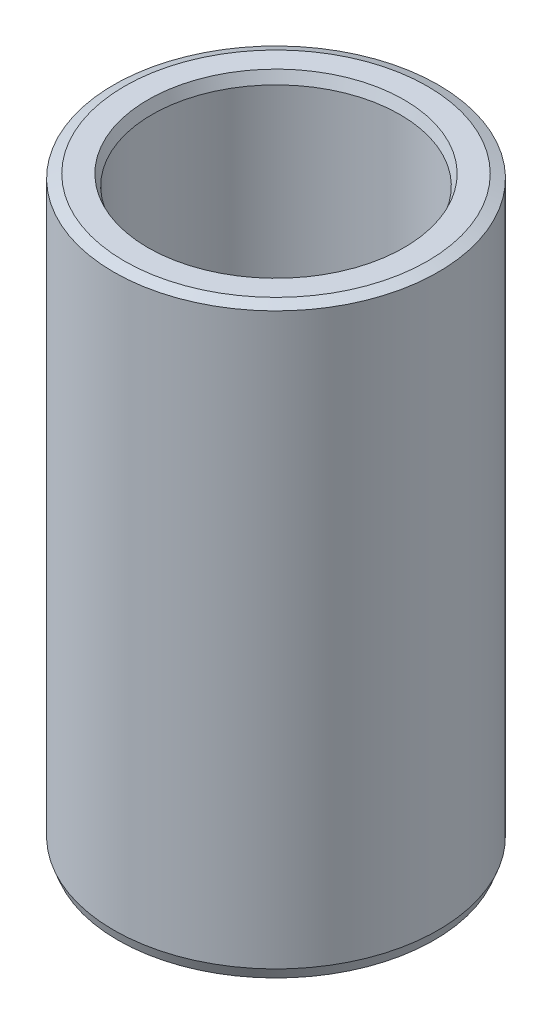
ISO-10303-21;
HEADER;
FILE_DESCRIPTION(('STEP AP214'),'2;1');
FILE_NAME('part.step','',(''),(''),'','','');
FILE_SCHEMA(('AUTOMOTIVE_DESIGN { 1 0 10303 214 1 1 1 1 }'));
ENDSEC;
DATA;
#1=APPLICATION_CONTEXT('core data for automotive mechanical design processes');
#2=APPLICATION_PROTOCOL_DEFINITION('international standard','automotive_design',2000,#1);
#3=PRODUCT_CONTEXT('',#1,'mechanical');
#4=PRODUCT('Part','Part','',(#3));
#5=PRODUCT_RELATED_PRODUCT_CATEGORY('part','',(#4));
#6=PRODUCT_DEFINITION_FORMATION('','',#4);
#7=PRODUCT_DEFINITION_CONTEXT('part definition',#1,'design');
#8=PRODUCT_DEFINITION('design','',#6,#7);
#9=PRODUCT_DEFINITION_SHAPE('','',#8);
#10=(LENGTH_UNIT() NAMED_UNIT(*) SI_UNIT(.MILLI.,.METRE.));
#11=(NAMED_UNIT(*) PLANE_ANGLE_UNIT() SI_UNIT($,.RADIAN.));
#12=(NAMED_UNIT(*) SI_UNIT($,.STERADIAN.) SOLID_ANGLE_UNIT());
#13=UNCERTAINTY_MEASURE_WITH_UNIT(LENGTH_MEASURE(1.E-05),#10,'distance_accuracy_value','');
#14=(GEOMETRIC_REPRESENTATION_CONTEXT(3) GLOBAL_UNCERTAINTY_ASSIGNED_CONTEXT((#13)) GLOBAL_UNIT_ASSIGNED_CONTEXT((#10,
#11,#12)) REPRESENTATION_CONTEXT('',''));
#15=CARTESIAN_POINT('',(0.,0.,0.));
#16=DIRECTION('',(0.,0.,1.));
#17=DIRECTION('',(1.,0.,0.));
#18=AXIS2_PLACEMENT_3D('',#15,#16,#17);
#19=CARTESIAN_POINT('',(0.,117.128344231377,0.));
#20=DIRECTION('',(0.,-1.,0.));
#21=DIRECTION('',(0.,0.,-1.));
#22=AXIS2_PLACEMENT_3D('',#19,#20,#21);
#23=CYLINDRICAL_SURFACE('',#22,32.5);
#24=CARTESIAN_POINT('',(0.,2.15137789199901,0.));
#25=DIRECTION('',(0.,1.,0.));
#26=DIRECTION('',(0.,0.,1.));
#27=AXIS2_PLACEMENT_3D('',#24,#25,#26);
#28=CIRCLE('',#27,32.5);
#29=CARTESIAN_POINT('',(0.,2.15137789199901,-32.5));
#30=VERTEX_POINT('',#29);
#31=EDGE_CURVE('E10',#30,#30,#28,.T.);
#32=CARTESIAN_POINT('',(0.,116.304025683068,0.));
#33=DIRECTION('',(0.,1.,0.));
#34=DIRECTION('',(0.,0.,1.));
#35=AXIS2_PLACEMENT_3D('',#32,#33,#34);
#36=CIRCLE('',#35,32.5);
#37=CARTESIAN_POINT('',(0.,116.304025683068,-32.5));
#38=VERTEX_POINT('',#37);
#39=EDGE_CURVE('E50',#38,#38,#36,.F.);
#40=CARTESIAN_POINT('',(0.,2.15137789199901,-32.5));
#41=CARTESIAN_POINT('',(0.,3.34046797315599,-32.5));
#42=CARTESIAN_POINT('',(0.,4.52955805431296,-32.5));
#43=CARTESIAN_POINT('',(0.,6.9077382166269,-32.5));
#44=CARTESIAN_POINT('',(0.,8.09682829778387,-32.5));
#45=CARTESIAN_POINT('',(0.,10.4750084600978,-32.5));
#46=CARTESIAN_POINT('',(0.,11.6640985412548,-32.5));
#47=CARTESIAN_POINT('',(0.,14.0422787035687,-32.5));
#48=CARTESIAN_POINT('',(0.,15.2313687847257,-32.5));
#49=CARTESIAN_POINT('',(0.,17.6095489470396,-32.5));
#50=CARTESIAN_POINT('',(0.,18.7986390281966,-32.5));
#51=CARTESIAN_POINT('',(0.,21.1768191905106,-32.5));
#52=CARTESIAN_POINT('',(0.,22.3659092716675,-32.5));
#53=CARTESIAN_POINT('',(0.,24.7440894339815,-32.5));
#54=CARTESIAN_POINT('',(0.,25.9331795151384,-32.5));
#55=CARTESIAN_POINT('',(0.,28.3113596774524,-32.5));
#56=CARTESIAN_POINT('',(0.,29.5004497586094,-32.5));
#57=CARTESIAN_POINT('',(0.,31.8786299209233,-32.5));
#58=CARTESIAN_POINT('',(0.,33.0677200020803,-32.5));
#59=CARTESIAN_POINT('',(0.,35.4459001643942,-32.5));
#60=CARTESIAN_POINT('',(0.,36.6349902455512,-32.5));
#61=CARTESIAN_POINT('',(0.,39.0131704078651,-32.5));
#62=CARTESIAN_POINT('',(0.,40.2022604890221,-32.5));
#63=CARTESIAN_POINT('',(0.,42.5804406513361,-32.5));
#64=CARTESIAN_POINT('',(0.,43.769530732493,-32.5));
#65=CARTESIAN_POINT('',(0.,46.147710894807,-32.5));
#66=CARTESIAN_POINT('',(0.,47.3368009759639,-32.5));
#67=CARTESIAN_POINT('',(0.,49.7149811382779,-32.5));
#68=CARTESIAN_POINT('',(0.,50.9040712194349,-32.5));
#69=CARTESIAN_POINT('',(0.,53.2822513817488,-32.5));
#70=CARTESIAN_POINT('',(0.,54.4713414629058,-32.5));
#71=CARTESIAN_POINT('',(0.,56.8495216252197,-32.5));
#72=CARTESIAN_POINT('',(0.,58.0386117063767,-32.5));
#73=CARTESIAN_POINT('',(0.,60.4167918686906,-32.5));
#74=CARTESIAN_POINT('',(0.,61.6058819498476,-32.5));
#75=CARTESIAN_POINT('',(0.,63.9840621121615,-32.5));
#76=CARTESIAN_POINT('',(0.,65.1731521933185,-32.5));
#77=CARTESIAN_POINT('',(0.,67.5513323556325,-32.5));
#78=CARTESIAN_POINT('',(0.,68.7404224367894,-32.5));
#79=CARTESIAN_POINT('',(0.,71.1186025991034,-32.5));
#80=CARTESIAN_POINT('',(0.,72.3076926802603,-32.5));
#81=CARTESIAN_POINT('',(0.,74.6858728425743,-32.5));
#82=CARTESIAN_POINT('',(0.,75.8749629237312,-32.5));
#83=CARTESIAN_POINT('',(0.,78.2531430860452,-32.5));
#84=CARTESIAN_POINT('',(0.,79.4422331672022,-32.5));
#85=CARTESIAN_POINT('',(0.,81.8204133295161,-32.5));
#86=CARTESIAN_POINT('',(0.,83.0095034106731,-32.5));
#87=CARTESIAN_POINT('',(0.,85.387683572987,-32.5));
#88=CARTESIAN_POINT('',(0.,86.576773654144,-32.5));
#89=CARTESIAN_POINT('',(0.,88.9549538164579,-32.5));
#90=CARTESIAN_POINT('',(0.,90.1440438976149,-32.5));
#91=CARTESIAN_POINT('',(0.,92.5222240599289,-32.5));
#92=CARTESIAN_POINT('',(0.,93.7113141410858,-32.5));
#93=CARTESIAN_POINT('',(0.,96.0894943033998,-32.5));
#94=CARTESIAN_POINT('',(0.,97.2785843845567,-32.5));
#95=CARTESIAN_POINT('',(0.,99.6567645468707,-32.5));
#96=CARTESIAN_POINT('',(0.,100.845854628028,-32.5));
#97=CARTESIAN_POINT('',(0.,103.224034790342,-32.5));
#98=CARTESIAN_POINT('',(0.,104.413124871499,-32.5));
#99=CARTESIAN_POINT('',(0.,106.791305033813,-32.5));
#100=CARTESIAN_POINT('',(0.,107.980395114969,-32.5));
#101=CARTESIAN_POINT('',(0.,110.358575277283,-32.5));
#102=CARTESIAN_POINT('',(0.,111.54766535844,-32.5));
#103=CARTESIAN_POINT('',(0.,113.925845520754,-32.5));
#104=CARTESIAN_POINT('',(0.,115.114935601911,-32.5));
#105=CARTESIAN_POINT('',(0.,116.304025683068,-32.5));
#106=B_SPLINE_CURVE_WITH_KNOTS('',3,(#40,#41,#42,#43,#44,#45,#46,#47,#48,#49,#50,#51,#52,#53,
#54,#55,#56,#57,#58,#59,#60,#61,#62,#63,#64,#65,#66,#67,#68,#69,#70,#71,#72,#73,#74,#75,#76,#77,
#78,#79,#80,#81,#82,#83,#84,#85,#86,#87,#88,#89,#90,#91,#92,#93,#94,#95,#96,#97,#98,#99,#100,
#101,#102,#103,#104,#105),.UNSPECIFIED.,.F.,.F.,(4,2,2,2,2,2,2,2,2,2,2,2,2,2,2,2,2,2,2,2,2,2,2,
2,2,2,2,2,2,2,2,2,4),(0.,3.56727024347092,7.13454048694183,10.7018107304128,14.2690809738837,
17.8363512173546,21.4036214608255,24.9708917042964,28.5381619477673,32.1054321912382,
35.6727024347092,39.2399726781801,42.807242921651,46.3745131651219,49.9417834085928,
53.5090536520637,57.0763238955346,60.6435941390056,64.2108643824765,67.7781346259474,
71.3454048694183,74.9126751128892,78.4799453563601,82.047215599831,85.614485843302,
89.1817560867729,92.7490263302438,96.3162965737147,99.8835668171856,103.450837060657,
107.018107304127,110.585377547598,114.152647791069),.UNSPECIFIED.);
#107=EDGE_CURVE('BSEAM39',#30,#38,#106,.T.);
#108=ORIENTED_EDGE('',*,*,#31,.T.);
#109=ORIENTED_EDGE('',*,*,#39,.T.);
#110=ORIENTED_EDGE('',*,*,#107,.T.);
#111=ORIENTED_EDGE('',*,*,#107,.F.);
#112=EDGE_LOOP('',(#108,#110,#109,#111));
#113=FACE_BOUND('',#112,.T.);
#114=ADVANCED_FACE('F39',(#113),#23,.T.);
#115=CARTESIAN_POINT('',(0.,117.128344231377,0.));
#116=DIRECTION('',(0.,1.,0.));
#117=DIRECTION('',(0.,0.,1.));
#118=AXIS2_PLACEMENT_3D('',#115,#116,#117);
#119=PLANE('',#118);
#120=CARTESIAN_POINT('',(0.,117.128344231377,0.));
#121=DIRECTION('',(0.,1.,0.));
#122=DIRECTION('',(0.,0.,1.));
#123=AXIS2_PLACEMENT_3D('',#120,#121,#122);
#124=CIRCLE('',#123,25.6613854813614);
#125=CARTESIAN_POINT('',(0.,117.128344231377,25.6613854813614));
#126=VERTEX_POINT('',#125);
#127=EDGE_CURVE('E58',#126,#126,#124,.F.);
#128=ORIENTED_EDGE('',*,*,#127,.T.);
#129=EDGE_LOOP('',(#128));
#130=FACE_BOUND('',#129,.T.);
#131=CARTESIAN_POINT('',(0.,117.128344231377,0.));
#132=DIRECTION('',(0.,1.,0.));
#133=DIRECTION('',(0.,0.,1.));
#134=AXIS2_PLACEMENT_3D('',#131,#132,#133);
#135=CIRCLE('',#134,30.3486221080015);
#136=CARTESIAN_POINT('',(0.,117.128344231377,30.3486221080015));
#137=VERTEX_POINT('',#136);
#138=EDGE_CURVE('E61',#137,#137,#135,.T.);
#139=ORIENTED_EDGE('',*,*,#138,.T.);
#140=EDGE_LOOP('',(#139));
#141=FACE_BOUND('',#140,.T.);
#142=ADVANCED_FACE('F88',(#130,#141),#119,.T.);
#143=CARTESIAN_POINT('',(0.,0.,0.));
#144=DIRECTION('',(0.,1.,0.));
#145=DIRECTION('',(0.,0.,1.));
#146=AXIS2_PLACEMENT_3D('',#143,#144,#145);
#147=PLANE('',#146);
#148=CARTESIAN_POINT('',(0.,0.,0.));
#149=DIRECTION('',(0.,1.,0.));
#150=DIRECTION('',(0.,0.,1.));
#151=AXIS2_PLACEMENT_3D('',#148,#149,#150);
#152=CIRCLE('',#151,26.9884448250512);
#153=CARTESIAN_POINT('',(0.,0.,26.9884448250512));
#154=VERTEX_POINT('',#153);
#155=EDGE_CURVE('E51',#154,#154,#152,.T.);
#156=ORIENTED_EDGE('',*,*,#155,.T.);
#157=EDGE_LOOP('',(#156));
#158=FACE_BOUND('',#157,.T.);
#159=CARTESIAN_POINT('',(0.,0.,0.));
#160=DIRECTION('',(0.,1.,0.));
#161=DIRECTION('',(0.,0.,1.));
#162=AXIS2_PLACEMENT_3D('',#159,#160,#161);
#163=CIRCLE('',#162,31.6756814516913);
#164=CARTESIAN_POINT('',(0.,0.,31.6756814516913));
#165=VERTEX_POINT('',#164);
#166=EDGE_CURVE('E54',#165,#165,#163,.F.);
#167=ORIENTED_EDGE('',*,*,#166,.T.);
#168=EDGE_LOOP('',(#167));
#169=FACE_BOUND('',#168,.T.);
#170=ADVANCED_FACE('F83',(#158,#169),#147,.F.);
#171=CARTESIAN_POINT('',(0.,117.128344231377,0.));
#172=DIRECTION('',(0.,-1.,0.));
#173=DIRECTION('',(0.,0.,-1.));
#174=AXIS2_PLACEMENT_3D('',#171,#172,#173);
#175=CYLINDRICAL_SURFACE('',#174,24.8370669330528);
#176=CARTESIAN_POINT('',(0.,114.976966339378,0.));
#177=DIRECTION('',(0.,1.,0.));
#178=DIRECTION('',(0.,0.,1.));
#179=AXIS2_PLACEMENT_3D('',#176,#177,#178);
#180=CIRCLE('',#179,24.8370669330528);
#181=CARTESIAN_POINT('',(0.,114.976966339378,-24.8370669330528));
#182=VERTEX_POINT('',#181);
#183=EDGE_CURVE('E67',#182,#182,#180,.T.);
#184=CARTESIAN_POINT('',(0.,0.824318548308445,0.));
#185=DIRECTION('',(0.,1.,0.));
#186=DIRECTION('',(0.,0.,1.));
#187=AXIS2_PLACEMENT_3D('',#184,#185,#186);
#188=CIRCLE('',#187,24.8370669330528);
#189=CARTESIAN_POINT('',(0.,0.824318548308445,-24.8370669330528));
#190=VERTEX_POINT('',#189);
#191=EDGE_CURVE('E69',#190,#190,#188,.F.);
#192=CARTESIAN_POINT('',(0.,114.976966339378,-24.8370669330528));
#193=CARTESIAN_POINT('',(0.,113.787876258221,-24.8370669330528));
#194=CARTESIAN_POINT('',(0.,112.598786177064,-24.8370669330528));
#195=CARTESIAN_POINT('',(0.,110.22060601475,-24.8370669330528));
#196=CARTESIAN_POINT('',(0.,109.031515933593,-24.8370669330528));
#197=CARTESIAN_POINT('',(0.,106.653335771279,-24.8370669330528));
#198=CARTESIAN_POINT('',(0.,105.464245690122,-24.8370669330528));
#199=CARTESIAN_POINT('',(0.,103.086065527808,-24.8370669330528));
#200=CARTESIAN_POINT('',(0.,101.896975446651,-24.8370669330528));
#201=CARTESIAN_POINT('',(0.,99.5187952843371,-24.8370669330528));
#202=CARTESIAN_POINT('',(0.,98.3297052031802,-24.8370669330528));
#203=CARTESIAN_POINT('',(0.,95.9515250408662,-24.8370669330528));
#204=CARTESIAN_POINT('',(0.,94.7624349597093,-24.8370669330528));
#205=CARTESIAN_POINT('',(0.,92.3842547973953,-24.8370669330528));
#206=CARTESIAN_POINT('',(0.,91.1951647162383,-24.8370669330528));
#207=CARTESIAN_POINT('',(0.,88.8169845539244,-24.8370669330528));
#208=CARTESIAN_POINT('',(0.,87.6278944727674,-24.8370669330528));
#209=CARTESIAN_POINT('',(0.,85.2497143104535,-24.8370669330528));
#210=CARTESIAN_POINT('',(0.,84.0606242292965,-24.8370669330528));
#211=CARTESIAN_POINT('',(0.,81.6824440669826,-24.8370669330528));
#212=CARTESIAN_POINT('',(0.,80.4933539858256,-24.8370669330528));
#213=CARTESIAN_POINT('',(0.,78.1151738235116,-24.8370669330528));
#214=CARTESIAN_POINT('',(0.,76.9260837423546,-24.8370669330528));
#215=CARTESIAN_POINT('',(0.,74.5479035800407,-24.8370669330528));
#216=CARTESIAN_POINT('',(0.,73.3588134988837,-24.8370669330528));
#217=CARTESIAN_POINT('',(0.,70.9806333365698,-24.8370669330528));
#218=CARTESIAN_POINT('',(0.,69.7915432554128,-24.8370669330528));
#219=CARTESIAN_POINT('',(0.,67.4133630930989,-24.8370669330528));
#220=CARTESIAN_POINT('',(0.,66.2242730119419,-24.8370669330528));
#221=CARTESIAN_POINT('',(0.,63.846092849628,-24.8370669330528));
#222=CARTESIAN_POINT('',(0.,62.657002768471,-24.8370669330528));
#223=CARTESIAN_POINT('',(0.,60.278822606157,-24.8370669330528));
#224=CARTESIAN_POINT('',(0.,59.0897325250001,-24.8370669330528));
#225=CARTESIAN_POINT('',(0.,56.7115523626861,-24.8370669330528));
#226=CARTESIAN_POINT('',(0.,55.5224622815292,-24.8370669330528));
#227=CARTESIAN_POINT('',(0.,53.1442821192152,-24.8370669330528));
#228=CARTESIAN_POINT('',(0.,51.9551920380583,-24.8370669330528));
#229=CARTESIAN_POINT('',(0.,49.5770118757443,-24.8370669330528));
#230=CARTESIAN_POINT('',(0.,48.3879217945873,-24.8370669330528));
#231=CARTESIAN_POINT('',(0.,46.0097416322734,-24.8370669330528));
#232=CARTESIAN_POINT('',(0.,44.8206515511164,-24.8370669330528));
#233=CARTESIAN_POINT('',(0.,42.4424713888025,-24.8370669330528));
#234=CARTESIAN_POINT('',(0.,41.2533813076455,-24.8370669330528));
#235=CARTESIAN_POINT('',(0.,38.8752011453316,-24.8370669330528));
#236=CARTESIAN_POINT('',(0.,37.6861110641746,-24.8370669330528));
#237=CARTESIAN_POINT('',(0.,35.3079309018606,-24.8370669330528));
#238=CARTESIAN_POINT('',(0.,34.1188408207037,-24.8370669330528));
#239=CARTESIAN_POINT('',(0.,31.7406606583897,-24.8370669330528));
#240=CARTESIAN_POINT('',(0.,30.5515705772328,-24.8370669330528));
#241=CARTESIAN_POINT('',(0.,28.1733904149188,-24.8370669330528));
#242=CARTESIAN_POINT('',(0.,26.9843003337618,-24.8370669330528));
#243=CARTESIAN_POINT('',(0.,24.6061201714479,-24.8370669330528));
#244=CARTESIAN_POINT('',(0.,23.4170300902909,-24.8370669330528));
#245=CARTESIAN_POINT('',(0.,21.038849927977,-24.8370669330528));
#246=CARTESIAN_POINT('',(0.,19.84975984682,-24.8370669330528));
#247=CARTESIAN_POINT('',(0.,17.4715796845061,-24.8370669330528));
#248=CARTESIAN_POINT('',(0.,16.2824896033491,-24.8370669330528));
#249=CARTESIAN_POINT('',(0.,13.9043094410351,-24.8370669330528));
#250=CARTESIAN_POINT('',(0.,12.7152193598782,-24.8370669330528));
#251=CARTESIAN_POINT('',(0.,10.3370391975642,-24.8370669330528));
#252=CARTESIAN_POINT('',(0.,9.14794911640723,-24.8370669330528));
#253=CARTESIAN_POINT('',(0.,6.7697689540933,-24.8370669330528));
#254=CARTESIAN_POINT('',(0.,5.58067887293633,-24.8370669330528));
#255=CARTESIAN_POINT('',(0.,3.20249871062239,-24.8370669330528));
#256=CARTESIAN_POINT('',(0.,2.01340862946542,-24.8370669330528));
#257=CARTESIAN_POINT('',(0.,0.824318548308445,-24.8370669330528));
#258=B_SPLINE_CURVE_WITH_KNOTS('',3,(#192,#193,#194,#195,#196,#197,#198,#199,#200,#201,#202,
#203,#204,#205,#206,#207,#208,#209,#210,#211,#212,#213,#214,#215,#216,#217,#218,#219,#220,#221,
#222,#223,#224,#225,#226,#227,#228,#229,#230,#231,#232,#233,#234,#235,#236,#237,#238,#239,#240,
#241,#242,#243,#244,#245,#246,#247,#248,#249,#250,#251,#252,#253,#254,#255,#256,#257),
.UNSPECIFIED.,.F.,.F.,(4,2,2,2,2,2,2,2,2,2,2,2,2,2,2,2,2,2,2,2,2,2,2,2,2,2,2,2,2,2,2,2,4),(0.,
3.56727024347092,7.13454048694184,10.7018107304128,14.2690809738837,17.8363512173546,
21.4036214608255,24.9708917042964,28.5381619477673,32.1054321912383,35.6727024347092,
39.2399726781801,42.807242921651,46.3745131651219,49.9417834085928,53.5090536520638,
57.0763238955347,60.6435941390056,64.2108643824765,67.7781346259474,71.3454048694183,
74.9126751128892,78.4799453563602,82.0472155998311,85.614485843302,89.1817560867729,
92.7490263302438,96.3162965737148,99.8835668171857,103.450837060657,107.018107304128,
110.585377547598,114.152647791069),.UNSPECIFIED.);
#259=EDGE_CURVE('BSEAM71',#182,#190,#258,.T.);
#260=ORIENTED_EDGE('',*,*,#183,.T.);
#261=ORIENTED_EDGE('',*,*,#191,.T.);
#262=ORIENTED_EDGE('',*,*,#259,.T.);
#263=ORIENTED_EDGE('',*,*,#259,.F.);
#264=EDGE_LOOP('',(#260,#262,#261,#263));
#265=FACE_BOUND('',#264,.T.);
#266=ADVANCED_FACE('F71',(#265),#175,.F.);
#267=CARTESIAN_POINT('',(0.,114.976966339378,0.));
#268=DIRECTION('',(0.,1.,0.));
#269=DIRECTION('',(0.,0.,1.));
#270=AXIS2_PLACEMENT_3D('',#267,#268,#269);
#271=CONICAL_SURFACE('',#270,24.8370669330528,0.365904000903931);
#272=ORIENTED_EDGE('',*,*,#127,.F.);
#273=EDGE_LOOP('',(#272));
#274=FACE_BOUND('',#273,.T.);
#275=ORIENTED_EDGE('',*,*,#183,.F.);
#276=EDGE_LOOP('',(#275));
#277=FACE_BOUND('',#276,.T.);
#278=ADVANCED_FACE('F77',(#274,#277),#271,.F.);
#279=CARTESIAN_POINT('',(0.,0.,0.));
#280=DIRECTION('',(0.,-1.,0.));
#281=DIRECTION('',(0.,0.,-1.));
#282=AXIS2_PLACEMENT_3D('',#279,#280,#281);
#283=CONICAL_SURFACE('',#282,26.9884448250512,1.20489232589096);
#284=ORIENTED_EDGE('',*,*,#191,.F.);
#285=EDGE_LOOP('',(#284));
#286=FACE_BOUND('',#285,.T.);
#287=ORIENTED_EDGE('',*,*,#155,.F.);
#288=EDGE_LOOP('',(#287));
#289=FACE_BOUND('',#288,.T.);
#290=ADVANCED_FACE('F73',(#286,#289),#283,.F.);
#291=CARTESIAN_POINT('',(0.,2.15137789199901,0.));
#292=DIRECTION('',(0.,1.,0.));
#293=DIRECTION('',(0.,0.,1.));
#294=AXIS2_PLACEMENT_3D('',#291,#292,#293);
#295=CONICAL_SURFACE('',#294,32.5,0.365904000903941);
#296=ORIENTED_EDGE('',*,*,#166,.F.);
#297=EDGE_LOOP('',(#296));
#298=FACE_BOUND('',#297,.T.);
#299=ORIENTED_EDGE('',*,*,#31,.F.);
#300=EDGE_LOOP('',(#299));
#301=FACE_BOUND('',#300,.T.);
#302=ADVANCED_FACE('F76',(#298,#301),#295,.T.);
#303=CARTESIAN_POINT('',(0.,117.128344231377,0.));
#304=DIRECTION('',(0.,-1.,0.));
#305=DIRECTION('',(0.,0.,-1.));
#306=AXIS2_PLACEMENT_3D('',#303,#304,#305);
#307=CONICAL_SURFACE('',#306,30.3486221080015,1.20489232589096);
#308=ORIENTED_EDGE('',*,*,#39,.F.);
#309=EDGE_LOOP('',(#308));
#310=FACE_BOUND('',#309,.T.);
#311=ORIENTED_EDGE('',*,*,#138,.F.);
#312=EDGE_LOOP('',(#311));
#313=FACE_BOUND('',#312,.T.);
#314=ADVANCED_FACE('F45',(#310,#313),#307,.T.);
#315=CLOSED_SHELL('',(#114,#142,#170,#266,#278,#290,#302,#314));
#316=MANIFOLD_SOLID_BREP('B2',#315);
#317=ADVANCED_BREP_SHAPE_REPRESENTATION('',(#18,#316),#14);
#318=SHAPE_DEFINITION_REPRESENTATION(#9,#317);
ENDSEC;
END-ISO-10303-21;
